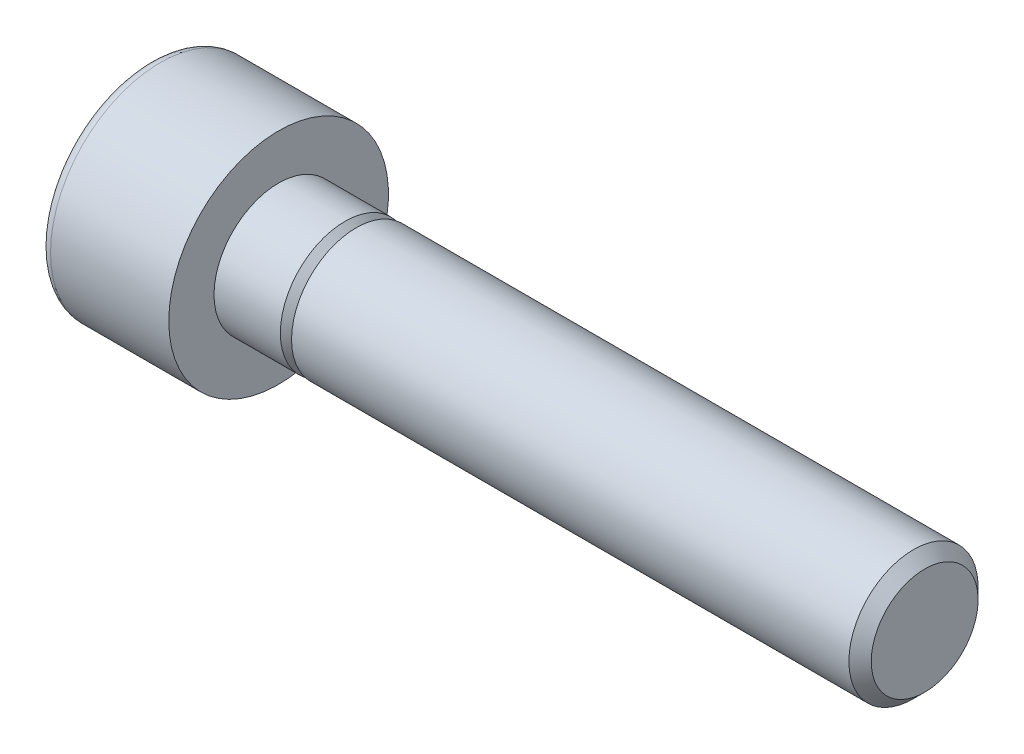
ISO-10303-21;
HEADER;
FILE_DESCRIPTION(('STEP AP214'),'2;1');
FILE_NAME('part.step','',(''),(''),'','','');
FILE_SCHEMA(('AUTOMOTIVE_DESIGN { 1 0 10303 214 1 1 1 1 }'));
ENDSEC;
DATA;
#1=APPLICATION_CONTEXT('core data for automotive mechanical design processes');
#2=APPLICATION_PROTOCOL_DEFINITION('international standard','automotive_design',2000,#1);
#3=PRODUCT_CONTEXT('',#1,'mechanical');
#4=PRODUCT('Part','Part','',(#3));
#5=PRODUCT_RELATED_PRODUCT_CATEGORY('part','',(#4));
#6=PRODUCT_DEFINITION_FORMATION('','',#4);
#7=PRODUCT_DEFINITION_CONTEXT('part definition',#1,'design');
#8=PRODUCT_DEFINITION('design','',#6,#7);
#9=PRODUCT_DEFINITION_SHAPE('','',#8);
#10=(LENGTH_UNIT() NAMED_UNIT(*) SI_UNIT(.MILLI.,.METRE.));
#11=(NAMED_UNIT(*) PLANE_ANGLE_UNIT() SI_UNIT($,.RADIAN.));
#12=(NAMED_UNIT(*) SI_UNIT($,.STERADIAN.) SOLID_ANGLE_UNIT());
#13=UNCERTAINTY_MEASURE_WITH_UNIT(LENGTH_MEASURE(1.E-05),#10,'distance_accuracy_value','');
#14=(GEOMETRIC_REPRESENTATION_CONTEXT(3) GLOBAL_UNCERTAINTY_ASSIGNED_CONTEXT((#13)) GLOBAL_UNIT_ASSIGNED_CONTEXT((#10,
#11,#12)) REPRESENTATION_CONTEXT('',''));
#15=CARTESIAN_POINT('',(0.,0.,0.));
#16=DIRECTION('',(0.,0.,1.));
#17=DIRECTION('',(1.,0.,0.));
#18=AXIS2_PLACEMENT_3D('',#15,#16,#17);
#19=CARTESIAN_POINT('',(0.,0.,0.));
#20=DIRECTION('',(-1.,0.,0.));
#21=DIRECTION('',(0.,0.,1.));
#22=AXIS2_PLACEMENT_3D('',#19,#20,#21);
#23=PLANE('',#22);
#24=CARTESIAN_POINT('',(0.,0.,0.));
#25=DIRECTION('',(-1.,0.,0.));
#26=DIRECTION('',(0.,0.,1.));
#27=AXIS2_PLACEMENT_3D('',#24,#25,#26);
#28=CIRCLE('',#27,4.25);
#29=CARTESIAN_POINT('',(0.,0.,4.25));
#30=VERTEX_POINT('',#29);
#31=EDGE_CURVE('E109',#30,#30,#28,.T.);
#32=ORIENTED_EDGE('',*,*,#31,.F.);
#33=EDGE_LOOP('',(#32));
#34=FACE_BOUND('',#33,.T.);
#35=CARTESIAN_POINT('',(0.,0.,0.));
#36=DIRECTION('',(-1.,0.,0.));
#37=DIRECTION('',(0.,0.,1.));
#38=AXIS2_PLACEMENT_3D('',#35,#36,#37);
#39=CIRCLE('',#38,2.5);
#40=CARTESIAN_POINT('',(0.,0.,2.5));
#41=VERTEX_POINT('',#40);
#42=EDGE_CURVE('E11',#41,#41,#39,.F.);
#43=ORIENTED_EDGE('',*,*,#42,.F.);
#44=EDGE_LOOP('',(#43));
#45=FACE_BOUND('',#44,.T.);
#46=ADVANCED_FACE('F16',(#34,#45),#23,.F.);
#47=CARTESIAN_POINT('',(-5.,3.825,0.));
#48=DIRECTION('',(1.,0.,0.));
#49=DIRECTION('',(0.,0.,-1.));
#50=AXIS2_PLACEMENT_3D('',#47,#48,#49);
#51=PLANE('',#50);
#52=CARTESIAN_POINT('',(-5.,0.,0.));
#53=DIRECTION('',(-1.,0.,0.));
#54=DIRECTION('',(0.,0.,1.));
#55=AXIS2_PLACEMENT_3D('',#52,#53,#54);
#56=CIRCLE('',#55,3.825);
#57=CARTESIAN_POINT('',(-5.,0.,3.825));
#58=VERTEX_POINT('',#57);
#59=EDGE_CURVE('E91',#58,#58,#56,.T.);
#60=ORIENTED_EDGE('',*,*,#59,.T.);
#61=EDGE_LOOP('',(#60));
#62=FACE_BOUND('',#61,.T.);
#63=DIRECTION('',(0.,0.5,0.866025403784438));
#64=VECTOR('',#63,1.);
#65=CARTESIAN_POINT('',(-5.,-0.775800807568874,2.65627358473774));
#66=LINE('',#65,#64);
#67=CARTESIAN_POINT('',(-5.,-2.30940107675851,0.));
#68=VERTEX_POINT('',#67);
#69=CARTESIAN_POINT('',(-5.,-1.15470053837925,2.));
#70=VERTEX_POINT('',#69);
#71=EDGE_CURVE('E25',#68,#70,#66,.T.);
#72=ORIENTED_EDGE('',*,*,#71,.F.);
#73=DIRECTION('',(0.,-0.5,0.866025403784439));
#74=VECTOR('',#73,1.);
#75=CARTESIAN_POINT('',(-5.,-0.775800807568879,-2.65627358473774));
#76=LINE('',#75,#74);
#77=CARTESIAN_POINT('',(-5.,-1.15470053837925,-2.));
#78=VERTEX_POINT('',#77);
#79=EDGE_CURVE('E40',#78,#68,#76,.T.);
#80=ORIENTED_EDGE('',*,*,#79,.F.);
#81=DIRECTION('',(0.,-1.,0.));
#82=VECTOR('',#81,1.);
#83=CARTESIAN_POINT('',(-5.,3.825,-2.));
#84=LINE('',#83,#82);
#85=CARTESIAN_POINT('',(-5.,1.15470053837925,-2.));
#86=VERTEX_POINT('',#85);
#87=EDGE_CURVE('E122',#86,#78,#84,.T.);
#88=ORIENTED_EDGE('',*,*,#87,.F.);
#89=DIRECTION('',(0.,-0.5,-0.866025403784439));
#90=VECTOR('',#89,1.);
#91=CARTESIAN_POINT('',(-5.,2.68830080756888,0.656273584737739));
#92=LINE('',#91,#90);
#93=CARTESIAN_POINT('',(-5.,2.30940107675851,0.));
#94=VERTEX_POINT('',#93);
#95=EDGE_CURVE('E119',#94,#86,#92,.T.);
#96=ORIENTED_EDGE('',*,*,#95,.F.);
#97=DIRECTION('',(0.,0.5,-0.866025403784439));
#98=VECTOR('',#97,1.);
#99=CARTESIAN_POINT('',(-5.,2.68830080756888,-0.656273584737739));
#100=LINE('',#99,#98);
#101=CARTESIAN_POINT('',(-5.,1.15470053837925,2.));
#102=VERTEX_POINT('',#101);
#103=EDGE_CURVE('E116',#102,#94,#100,.T.);
#104=ORIENTED_EDGE('',*,*,#103,.F.);
#105=DIRECTION('',(0.,1.,0.));
#106=VECTOR('',#105,1.);
#107=CARTESIAN_POINT('',(-5.,3.825,2.));
#108=LINE('',#107,#106);
#109=EDGE_CURVE('E113',#70,#102,#108,.T.);
#110=ORIENTED_EDGE('',*,*,#109,.F.);
#111=EDGE_LOOP('',(#72,#80,#88,#96,#104,#110));
#112=FACE_BOUND('',#111,.T.);
#113=ADVANCED_FACE('F18',(#62,#112),#51,.F.);
#114=CARTESIAN_POINT('',(-5.,0.,0.));
#115=DIRECTION('',(-1.,0.,0.));
#116=DIRECTION('',(0.,0.,1.));
#117=AXIS2_PLACEMENT_3D('',#114,#115,#116);
#118=CYLINDRICAL_SURFACE('',#117,4.25);
#119=CARTESIAN_POINT('',(-4.575,0.,0.));
#120=DIRECTION('',(-1.,0.,0.));
#121=DIRECTION('',(0.,0.,1.));
#122=AXIS2_PLACEMENT_3D('',#119,#120,#121);
#123=CIRCLE('',#122,4.25);
#124=CARTESIAN_POINT('',(-4.575,0.,4.25));
#125=VERTEX_POINT('',#124);
#126=EDGE_CURVE('E99',#125,#125,#123,.T.);
#127=ORIENTED_EDGE('',*,*,#126,.F.);
#128=EDGE_LOOP('',(#127));
#129=FACE_BOUND('',#128,.T.);
#130=ORIENTED_EDGE('',*,*,#31,.T.);
#131=EDGE_LOOP('',(#130));
#132=FACE_BOUND('',#131,.T.);
#133=ADVANCED_FACE('F238',(#129,#132),#118,.T.);
#134=CARTESIAN_POINT('',(-4.575,0.,0.));
#135=DIRECTION('',(-1.,0.,0.));
#136=DIRECTION('',(0.,0.,1.));
#137=AXIS2_PLACEMENT_3D('',#134,#135,#136);
#138=TOROIDAL_SURFACE('',#137,3.825,0.425);
#139=ORIENTED_EDGE('',*,*,#59,.F.);
#140=EDGE_LOOP('',(#139));
#141=FACE_BOUND('',#140,.T.);
#142=ORIENTED_EDGE('',*,*,#126,.T.);
#143=EDGE_LOOP('',(#142));
#144=FACE_BOUND('',#143,.T.);
#145=ADVANCED_FACE('F245',(#141,#144),#138,.T.);
#146=CARTESIAN_POINT('',(-2.5,-1.15470053837925,2.));
#147=DIRECTION('',(0.,0.866025403784438,-0.5));
#148=DIRECTION('',(0.,0.5,0.866025403784438));
#149=AXIS2_PLACEMENT_3D('',#146,#147,#148);
#150=PLANE('',#149);
#151=ORIENTED_EDGE('',*,*,#71,.T.);
#152=DIRECTION('',(-1.,0.,0.));
#153=VECTOR('',#152,1.);
#154=CARTESIAN_POINT('',(-2.5,-1.15470053837925,2.));
#155=LINE('',#154,#153);
#156=CARTESIAN_POINT('',(-2.5,-1.15470053837925,2.));
#157=VERTEX_POINT('',#156);
#158=EDGE_CURVE('E32',#157,#70,#155,.T.);
#159=ORIENTED_EDGE('',*,*,#158,.F.);
#160=DIRECTION('',(0.,-0.5,-0.866025403784439));
#161=VECTOR('',#160,1.);
#162=CARTESIAN_POINT('',(-2.5,-1.15470053837925,2.));
#163=LINE('',#162,#161);
#164=CARTESIAN_POINT('',(-2.5,-2.30940107675851,0.));
#165=VERTEX_POINT('',#164);
#166=EDGE_CURVE('E76',#157,#165,#163,.T.);
#167=ORIENTED_EDGE('',*,*,#166,.T.);
#168=DIRECTION('',(-1.,0.,0.));
#169=VECTOR('',#168,1.);
#170=CARTESIAN_POINT('',(-2.5,-2.30940107675851,0.));
#171=LINE('',#170,#169);
#172=EDGE_CURVE('E84',#165,#68,#171,.T.);
#173=ORIENTED_EDGE('',*,*,#172,.T.);
#174=EDGE_LOOP('',(#151,#159,#167,#173));
#175=FACE_BOUND('',#174,.T.);
#176=ADVANCED_FACE('F83',(#175),#150,.T.);
#177=CARTESIAN_POINT('',(-2.5,-2.30940107675851,0.));
#178=DIRECTION('',(0.,0.866025403784439,0.5));
#179=DIRECTION('',(0.,-0.5,0.866025403784439));
#180=AXIS2_PLACEMENT_3D('',#177,#178,#179);
#181=PLANE('',#180);
#182=ORIENTED_EDGE('',*,*,#79,.T.);
#183=ORIENTED_EDGE('',*,*,#172,.F.);
#184=DIRECTION('',(0.,0.5,-0.866025403784439));
#185=VECTOR('',#184,1.);
#186=CARTESIAN_POINT('',(-2.5,-2.30940107675851,0.));
#187=LINE('',#186,#185);
#188=CARTESIAN_POINT('',(-2.5,-1.15470053837925,-2.));
#189=VERTEX_POINT('',#188);
#190=EDGE_CURVE('E72',#165,#189,#187,.T.);
#191=ORIENTED_EDGE('',*,*,#190,.T.);
#192=DIRECTION('',(-1.,0.,0.));
#193=VECTOR('',#192,1.);
#194=CARTESIAN_POINT('',(-2.5,-1.15470053837925,-2.));
#195=LINE('',#194,#193);
#196=EDGE_CURVE('E92',#189,#78,#195,.T.);
#197=ORIENTED_EDGE('',*,*,#196,.T.);
#198=EDGE_LOOP('',(#182,#183,#191,#197));
#199=FACE_BOUND('',#198,.T.);
#200=ADVANCED_FACE('F89',(#199),#181,.T.);
#201=CARTESIAN_POINT('',(-2.5,-1.15470053837925,-2.));
#202=DIRECTION('',(0.,0.,1.));
#203=DIRECTION('',(0.,-1.,0.));
#204=AXIS2_PLACEMENT_3D('',#201,#202,#203);
#205=PLANE('',#204);
#206=ORIENTED_EDGE('',*,*,#87,.T.);
#207=ORIENTED_EDGE('',*,*,#196,.F.);
#208=DIRECTION('',(0.,1.,0.));
#209=VECTOR('',#208,1.);
#210=CARTESIAN_POINT('',(-2.5,-1.15470053837925,-2.));
#211=LINE('',#210,#209);
#212=CARTESIAN_POINT('',(-2.5,1.15470053837925,-2.));
#213=VERTEX_POINT('',#212);
#214=EDGE_CURVE('E78',#189,#213,#211,.T.);
#215=ORIENTED_EDGE('',*,*,#214,.T.);
#216=DIRECTION('',(-1.,0.,0.));
#217=VECTOR('',#216,1.);
#218=CARTESIAN_POINT('',(-2.5,1.15470053837925,-2.));
#219=LINE('',#218,#217);
#220=EDGE_CURVE('E102',#213,#86,#219,.T.);
#221=ORIENTED_EDGE('',*,*,#220,.T.);
#222=EDGE_LOOP('',(#206,#207,#215,#221));
#223=FACE_BOUND('',#222,.T.);
#224=ADVANCED_FACE('F161',(#223),#205,.T.);
#225=CARTESIAN_POINT('',(-2.5,1.15470053837925,-2.));
#226=DIRECTION('',(0.,-0.866025403784438,0.5));
#227=DIRECTION('',(0.,-0.5,-0.866025403784439));
#228=AXIS2_PLACEMENT_3D('',#225,#226,#227);
#229=PLANE('',#228);
#230=ORIENTED_EDGE('',*,*,#95,.T.);
#231=ORIENTED_EDGE('',*,*,#220,.F.);
#232=DIRECTION('',(0.,0.5,0.866025403784439));
#233=VECTOR('',#232,1.);
#234=CARTESIAN_POINT('',(-2.5,1.15470053837925,-2.));
#235=LINE('',#234,#233);
#236=CARTESIAN_POINT('',(-2.5,2.30940107675851,0.));
#237=VERTEX_POINT('',#236);
#238=EDGE_CURVE('E164',#213,#237,#235,.T.);
#239=ORIENTED_EDGE('',*,*,#238,.T.);
#240=DIRECTION('',(-1.,0.,0.));
#241=VECTOR('',#240,1.);
#242=CARTESIAN_POINT('',(-2.5,2.30940107675851,0.));
#243=LINE('',#242,#241);
#244=EDGE_CURVE('E143',#237,#94,#243,.T.);
#245=ORIENTED_EDGE('',*,*,#244,.T.);
#246=EDGE_LOOP('',(#230,#231,#239,#245));
#247=FACE_BOUND('',#246,.T.);
#248=ADVANCED_FACE('F163',(#247),#229,.T.);
#249=CARTESIAN_POINT('',(-2.5,2.30940107675851,0.));
#250=DIRECTION('',(0.,-0.866025403784439,-0.5));
#251=DIRECTION('',(0.,0.5,-0.866025403784439));
#252=AXIS2_PLACEMENT_3D('',#249,#250,#251);
#253=PLANE('',#252);
#254=ORIENTED_EDGE('',*,*,#103,.T.);
#255=ORIENTED_EDGE('',*,*,#244,.F.);
#256=DIRECTION('',(0.,-0.5,0.866025403784439));
#257=VECTOR('',#256,1.);
#258=CARTESIAN_POINT('',(-2.5,2.30940107675851,0.));
#259=LINE('',#258,#257);
#260=CARTESIAN_POINT('',(-2.5,1.15470053837925,2.));
#261=VERTEX_POINT('',#260);
#262=EDGE_CURVE('E141',#237,#261,#259,.T.);
#263=ORIENTED_EDGE('',*,*,#262,.T.);
#264=DIRECTION('',(-1.,0.,0.));
#265=VECTOR('',#264,1.);
#266=CARTESIAN_POINT('',(-2.5,1.15470053837925,2.));
#267=LINE('',#266,#265);
#268=EDGE_CURVE('E135',#261,#102,#267,.T.);
#269=ORIENTED_EDGE('',*,*,#268,.T.);
#270=EDGE_LOOP('',(#254,#255,#263,#269));
#271=FACE_BOUND('',#270,.T.);
#272=ADVANCED_FACE('F137',(#271),#253,.T.);
#273=CARTESIAN_POINT('',(-2.5,1.15470053837925,2.));
#274=DIRECTION('',(0.,0.,-1.));
#275=DIRECTION('',(0.,1.,0.));
#276=AXIS2_PLACEMENT_3D('',#273,#274,#275);
#277=PLANE('',#276);
#278=ORIENTED_EDGE('',*,*,#109,.T.);
#279=ORIENTED_EDGE('',*,*,#268,.F.);
#280=DIRECTION('',(0.,-1.,0.));
#281=VECTOR('',#280,1.);
#282=CARTESIAN_POINT('',(-2.5,1.15470053837925,2.));
#283=LINE('',#282,#281);
#284=EDGE_CURVE('E151',#261,#157,#283,.T.);
#285=ORIENTED_EDGE('',*,*,#284,.T.);
#286=ORIENTED_EDGE('',*,*,#158,.T.);
#287=EDGE_LOOP('',(#278,#279,#285,#286));
#288=FACE_BOUND('',#287,.T.);
#289=ADVANCED_FACE('F134',(#288),#277,.T.);
#290=CARTESIAN_POINT('',(-2.5,-2.30940107675851,0.));
#291=DIRECTION('',(1.,0.,0.));
#292=DIRECTION('',(0.,0.,1.));
#293=AXIS2_PLACEMENT_3D('',#290,#291,#292);
#294=PLANE('',#293);
#295=ORIENTED_EDGE('',*,*,#166,.F.);
#296=ORIENTED_EDGE('',*,*,#284,.F.);
#297=ORIENTED_EDGE('',*,*,#262,.F.);
#298=ORIENTED_EDGE('',*,*,#238,.F.);
#299=ORIENTED_EDGE('',*,*,#214,.F.);
#300=ORIENTED_EDGE('',*,*,#190,.F.);
#301=EDGE_LOOP('',(#295,#296,#297,#298,#299,#300));
#302=FACE_BOUND('',#301,.T.);
#303=ADVANCED_FACE('F74',(#302),#294,.F.);
#304=CARTESIAN_POINT('',(0.,0.,0.));
#305=DIRECTION('',(-1.,0.,0.));
#306=DIRECTION('',(0.,0.,1.));
#307=AXIS2_PLACEMENT_3D('',#304,#305,#306);
#308=CYLINDRICAL_SURFACE('',#307,2.5);
#309=CARTESIAN_POINT('',(2.567,0.,0.));
#310=DIRECTION('',(-1.,0.,0.));
#311=DIRECTION('',(0.,0.,1.));
#312=AXIS2_PLACEMENT_3D('',#309,#310,#311);
#313=CIRCLE('',#312,2.5);
#314=CARTESIAN_POINT('',(2.567,0.,2.5));
#315=VERTEX_POINT('',#314);
#316=EDGE_CURVE('E189',#315,#315,#313,.T.);
#317=ORIENTED_EDGE('',*,*,#316,.T.);
#318=EDGE_LOOP('',(#317));
#319=FACE_BOUND('',#318,.T.);
#320=ORIENTED_EDGE('',*,*,#42,.T.);
#321=EDGE_LOOP('',(#320));
#322=FACE_BOUND('',#321,.T.);
#323=ADVANCED_FACE('F197',(#319,#322),#308,.T.);
#324=CARTESIAN_POINT('',(25.,0.,0.));
#325=DIRECTION('',(-1.,0.,0.));
#326=DIRECTION('',(0.,0.,1.));
#327=AXIS2_PLACEMENT_3D('',#324,#325,#326);
#328=PLANE('',#327);
#329=CARTESIAN_POINT('',(25.,0.,0.));
#330=DIRECTION('',(-1.,0.,0.));
#331=DIRECTION('',(0.,0.,1.));
#332=AXIS2_PLACEMENT_3D('',#329,#330,#331);
#333=CIRCLE('',#332,2.067);
#334=CARTESIAN_POINT('',(25.,0.,2.067));
#335=VERTEX_POINT('',#334);
#336=EDGE_CURVE('E87',#335,#335,#333,.T.);
#337=ORIENTED_EDGE('',*,*,#336,.F.);
#338=EDGE_LOOP('',(#337));
#339=FACE_BOUND('',#338,.T.);
#340=ADVANCED_FACE('F221',(#339),#328,.F.);
#341=CARTESIAN_POINT('',(25.,0.,0.));
#342=DIRECTION('',(-1.,0.,0.));
#343=DIRECTION('',(0.,0.,1.));
#344=AXIS2_PLACEMENT_3D('',#341,#342,#343);
#345=CONICAL_SURFACE('',#344,2.067,0.785398163397449);
#346=CARTESIAN_POINT('',(24.567,0.,0.));
#347=DIRECTION('',(-1.,0.,0.));
#348=DIRECTION('',(0.,0.,1.));
#349=AXIS2_PLACEMENT_3D('',#346,#347,#348);
#350=CIRCLE('',#349,2.5);
#351=CARTESIAN_POINT('',(24.567,0.,2.5));
#352=VERTEX_POINT('',#351);
#353=EDGE_CURVE('E177',#352,#352,#350,.T.);
#354=ORIENTED_EDGE('',*,*,#353,.F.);
#355=EDGE_LOOP('',(#354));
#356=FACE_BOUND('',#355,.T.);
#357=ORIENTED_EDGE('',*,*,#336,.T.);
#358=EDGE_LOOP('',(#357));
#359=FACE_BOUND('',#358,.T.);
#360=ADVANCED_FACE('F215',(#356,#359),#345,.T.);
#361=CARTESIAN_POINT('',(0.,0.,0.));
#362=DIRECTION('',(-1.,0.,0.));
#363=DIRECTION('',(0.,0.,1.));
#364=AXIS2_PLACEMENT_3D('',#361,#362,#363);
#365=CYLINDRICAL_SURFACE('',#364,2.5);
#366=CARTESIAN_POINT('',(3.,0.,0.));
#367=DIRECTION('',(-1.,0.,0.));
#368=DIRECTION('',(0.,0.,1.));
#369=AXIS2_PLACEMENT_3D('',#366,#367,#368);
#370=CIRCLE('',#369,2.5);
#371=CARTESIAN_POINT('',(3.,0.,2.5));
#372=VERTEX_POINT('',#371);
#373=EDGE_CURVE('E181',#372,#372,#370,.T.);
#374=ORIENTED_EDGE('',*,*,#373,.F.);
#375=EDGE_LOOP('',(#374));
#376=FACE_BOUND('',#375,.T.);
#377=ORIENTED_EDGE('',*,*,#353,.T.);
#378=EDGE_LOOP('',(#377));
#379=FACE_BOUND('',#378,.T.);
#380=ADVANCED_FACE('F209',(#376,#379),#365,.T.);
#381=CARTESIAN_POINT('',(3.,2.5,0.));
#382=DIRECTION('',(1.,0.,0.));
#383=DIRECTION('',(0.,0.,-1.));
#384=AXIS2_PLACEMENT_3D('',#381,#382,#383);
#385=PLANE('',#384);
#386=CARTESIAN_POINT('',(3.,0.,0.));
#387=DIRECTION('',(-1.,0.,0.));
#388=DIRECTION('',(0.,0.,1.));
#389=AXIS2_PLACEMENT_3D('',#386,#387,#388);
#390=CIRCLE('',#389,2.067);
#391=CARTESIAN_POINT('',(3.,0.,2.067));
#392=VERTEX_POINT('',#391);
#393=EDGE_CURVE('E185',#392,#392,#390,.T.);
#394=ORIENTED_EDGE('',*,*,#393,.F.);
#395=EDGE_LOOP('',(#394));
#396=FACE_BOUND('',#395,.T.);
#397=ORIENTED_EDGE('',*,*,#373,.T.);
#398=EDGE_LOOP('',(#397));
#399=FACE_BOUND('',#398,.T.);
#400=ADVANCED_FACE('F203',(#396,#399),#385,.F.);
#401=CARTESIAN_POINT('',(3.,0.,0.));
#402=DIRECTION('',(-1.,0.,0.));
#403=DIRECTION('',(0.,0.,1.));
#404=AXIS2_PLACEMENT_3D('',#401,#402,#403);
#405=CONICAL_SURFACE('',#404,2.067,0.785398163397448);
#406=ORIENTED_EDGE('',*,*,#316,.F.);
#407=EDGE_LOOP('',(#406));
#408=FACE_BOUND('',#407,.T.);
#409=ORIENTED_EDGE('',*,*,#393,.T.);
#410=EDGE_LOOP('',(#409));
#411=FACE_BOUND('',#410,.T.);
#412=ADVANCED_FACE('F200',(#408,#411),#405,.T.);
#413=CLOSED_SHELL('',(#46,#113,#133,#145,#176,#200,#224,#248,#272,#289,#303,#323,#340,#360,#380,
#400,#412));
#414=MANIFOLD_SOLID_BREP('B1',#413);
#415=ADVANCED_BREP_SHAPE_REPRESENTATION('',(#18,#414),#14);
#416=SHAPE_DEFINITION_REPRESENTATION(#9,#415);
ENDSEC;
END-ISO-10303-21;
